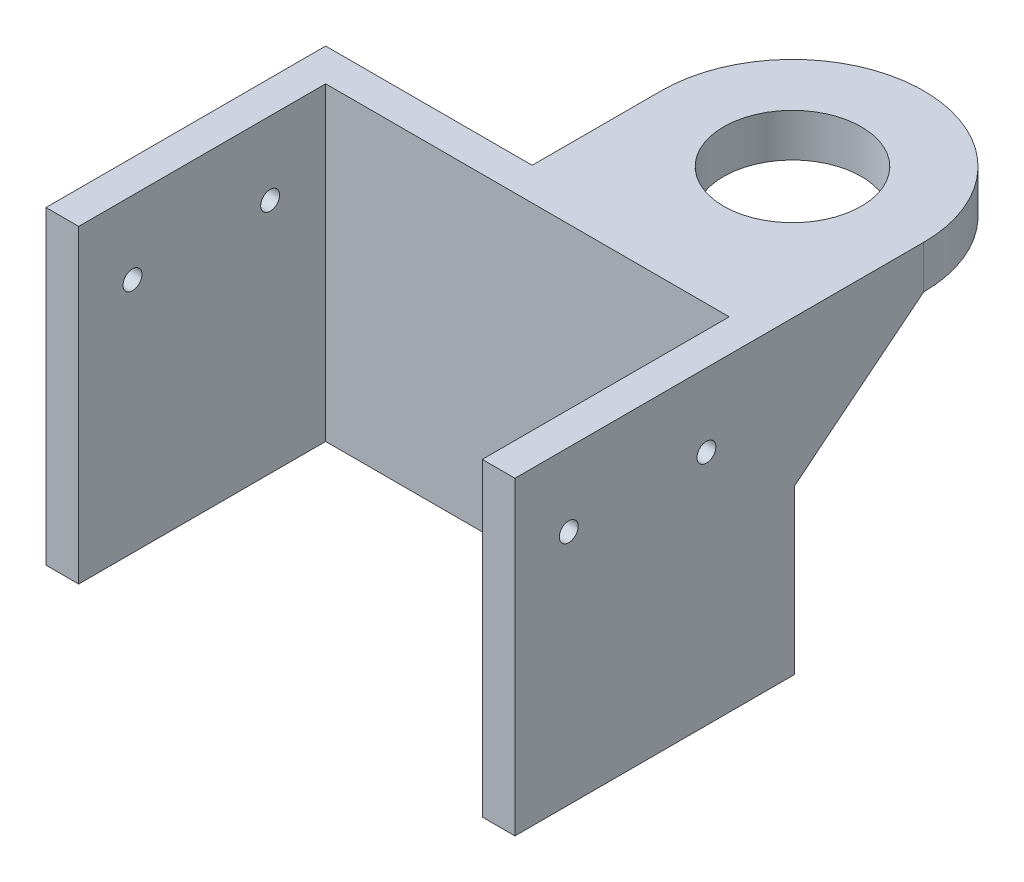
ISO-10303-21;
HEADER;
FILE_DESCRIPTION(('STEP AP214'),'2;1');
FILE_NAME('part.step','',(''),(''),'','','');
FILE_SCHEMA(('AUTOMOTIVE_DESIGN { 1 0 10303 214 1 1 1 1 }'));
ENDSEC;
DATA;
#1=APPLICATION_CONTEXT('core data for automotive mechanical design processes');
#2=APPLICATION_PROTOCOL_DEFINITION('international standard','automotive_design',2000,#1);
#3=PRODUCT_CONTEXT('',#1,'mechanical');
#4=PRODUCT('Part','Part','',(#3));
#5=PRODUCT_RELATED_PRODUCT_CATEGORY('part','',(#4));
#6=PRODUCT_DEFINITION_FORMATION('','',#4);
#7=PRODUCT_DEFINITION_CONTEXT('part definition',#1,'design');
#8=PRODUCT_DEFINITION('design','',#6,#7);
#9=PRODUCT_DEFINITION_SHAPE('','',#8);
#10=(LENGTH_UNIT() NAMED_UNIT(*) SI_UNIT(.MILLI.,.METRE.));
#11=(NAMED_UNIT(*) PLANE_ANGLE_UNIT() SI_UNIT($,.RADIAN.));
#12=(NAMED_UNIT(*) SI_UNIT($,.STERADIAN.) SOLID_ANGLE_UNIT());
#13=UNCERTAINTY_MEASURE_WITH_UNIT(LENGTH_MEASURE(1.E-05),#10,'distance_accuracy_value','');
#14=(GEOMETRIC_REPRESENTATION_CONTEXT(3) GLOBAL_UNCERTAINTY_ASSIGNED_CONTEXT((#13)) GLOBAL_UNIT_ASSIGNED_CONTEXT((#10,
#11,#12)) REPRESENTATION_CONTEXT('',''));
#15=CARTESIAN_POINT('',(0.,0.,0.));
#16=DIRECTION('',(0.,0.,1.));
#17=DIRECTION('',(1.,0.,0.));
#18=AXIS2_PLACEMENT_3D('',#15,#16,#17);
#19=CARTESIAN_POINT('',(-22.7158154859967,34.,12.6149093904448));
#20=DIRECTION('',(0.,0.,-1.));
#21=DIRECTION('',(-1.,0.,0.));
#22=AXIS2_PLACEMENT_3D('',#19,#20,#21);
#23=PLANE('',#22);
#24=DIRECTION('',(0.,-1.,0.));
#25=VECTOR('',#24,1.);
#26=CARTESIAN_POINT('',(-22.7158154859967,34.,12.6149093904448));
#27=LINE('',#26,#25);
#28=CARTESIAN_POINT('',(-22.7158154859967,34.,12.6149093904448));
#29=VERTEX_POINT('',#28);
#30=CARTESIAN_POINT('',(-22.7158154859967,-2.,12.6149093904448));
#31=VERTEX_POINT('',#30);
#32=EDGE_CURVE('E11',#29,#31,#27,.T.);
#33=ORIENTED_EDGE('',*,*,#32,.T.);
#34=DIRECTION('',(1.,0.,0.));
#35=VECTOR('',#34,1.);
#36=CARTESIAN_POINT('',(-18.9158154859967,-2.,12.6149093904448));
#37=LINE('',#36,#35);
#38=CARTESIAN_POINT('',(-18.9158154859967,-2.,12.6149093904448));
#39=VERTEX_POINT('',#38);
#40=EDGE_CURVE('E158',#31,#39,#37,.T.);
#41=ORIENTED_EDGE('',*,*,#40,.T.);
#42=DIRECTION('',(0.,1.,0.));
#43=VECTOR('',#42,1.);
#44=CARTESIAN_POINT('',(-18.9158154859967,0.,12.6149093904448));
#45=LINE('',#44,#43);
#46=CARTESIAN_POINT('',(-18.9158154859967,34.,12.6149093904448));
#47=VERTEX_POINT('',#46);
#48=EDGE_CURVE('E141',#39,#47,#45,.T.);
#49=ORIENTED_EDGE('',*,*,#48,.T.);
#50=DIRECTION('',(1.,0.,0.));
#51=VECTOR('',#50,1.);
#52=CARTESIAN_POINT('',(-22.7158154859967,34.,12.6149093904448));
#53=LINE('',#52,#51);
#54=EDGE_CURVE('E268',#29,#47,#53,.T.);
#55=ORIENTED_EDGE('',*,*,#54,.F.);
#56=EDGE_LOOP('',(#33,#41,#49,#55));
#57=FACE_BOUND('',#56,.T.);
#58=ADVANCED_FACE('F37',(#57),#23,.F.);
#59=CARTESIAN_POINT('',(-22.7158154859967,34.,-19.8850906095552));
#60=DIRECTION('',(0.,0.,1.));
#61=DIRECTION('',(1.,0.,0.));
#62=AXIS2_PLACEMENT_3D('',#59,#60,#61);
#63=PLANE('',#62);
#64=DIRECTION('',(1.,0.,0.));
#65=VECTOR('',#64,1.);
#66=CARTESIAN_POINT('',(27.7841845140033,17.,-19.8850906095552));
#67=LINE('',#66,#65);
#68=CARTESIAN_POINT('',(27.7841845140033,17.,-19.8850906095552));
#69=VERTEX_POINT('',#68);
#70=CARTESIAN_POINT('',(31.7841845140033,17.,-19.8850906095552));
#71=VERTEX_POINT('',#70);
#72=EDGE_CURVE('E225',#69,#71,#67,.T.);
#73=ORIENTED_EDGE('',*,*,#72,.T.);
#74=DIRECTION('',(0.,-1.,0.));
#75=VECTOR('',#74,1.);
#76=CARTESIAN_POINT('',(31.7841845140033,34.,-19.8850906095552));
#77=LINE('',#76,#75);
#78=CARTESIAN_POINT('',(31.7841845140033,-2.,-19.8850906095552));
#79=VERTEX_POINT('',#78);
#80=EDGE_CURVE('E275',#71,#79,#77,.T.);
#81=ORIENTED_EDGE('',*,*,#80,.T.);
#82=DIRECTION('',(-1.,0.,0.));
#83=VECTOR('',#82,1.);
#84=CARTESIAN_POINT('',(-22.7158154859967,-2.,-19.8850906095552));
#85=LINE('',#84,#83);
#86=CARTESIAN_POINT('',(-22.7158154859967,-2.,-19.8850906095552));
#87=VERTEX_POINT('',#86);
#88=EDGE_CURVE('E182',#79,#87,#85,.T.);
#89=ORIENTED_EDGE('',*,*,#88,.T.);
#90=DIRECTION('',(0.,-1.,0.));
#91=VECTOR('',#90,1.);
#92=CARTESIAN_POINT('',(-22.7158154859967,34.,-19.8850906095552));
#93=LINE('',#92,#91);
#94=CARTESIAN_POINT('',(-22.7158154859967,34.,-19.8850906095552));
#95=VERTEX_POINT('',#94);
#96=EDGE_CURVE('E273',#95,#87,#93,.T.);
#97=ORIENTED_EDGE('',*,*,#96,.F.);
#98=DIRECTION('',(-1.,0.,0.));
#99=VECTOR('',#98,1.);
#100=CARTESIAN_POINT('',(-22.7158154859967,34.,-19.8850906095552));
#101=LINE('',#100,#99);
#102=CARTESIAN_POINT('',(1.28418451400331,34.,-19.8850906095552));
#103=VERTEX_POINT('',#102);
#104=EDGE_CURVE('E54',#103,#95,#101,.T.);
#105=ORIENTED_EDGE('',*,*,#104,.F.);
#106=DIRECTION('',(0.,1.,0.));
#107=VECTOR('',#106,1.);
#108=CARTESIAN_POINT('',(1.28418451400331,29.,-19.8850906095552));
#109=LINE('',#108,#107);
#110=CARTESIAN_POINT('',(1.28418451400331,17.,-19.8850906095552));
#111=VERTEX_POINT('',#110);
#112=EDGE_CURVE('E264',#111,#103,#109,.T.);
#113=ORIENTED_EDGE('',*,*,#112,.F.);
#114=DIRECTION('',(-1.,0.,0.));
#115=VECTOR('',#114,1.);
#116=CARTESIAN_POINT('',(5.28418451400331,17.,-19.8850906095552));
#117=LINE('',#116,#115);
#118=CARTESIAN_POINT('',(5.28418451400331,17.,-19.8850906095552));
#119=VERTEX_POINT('',#118);
#120=EDGE_CURVE('E243',#119,#111,#117,.T.);
#121=ORIENTED_EDGE('',*,*,#120,.F.);
#122=DIRECTION('',(0.,1.,0.));
#123=VECTOR('',#122,1.);
#124=CARTESIAN_POINT('',(5.28418451400331,17.,-19.8850906095552));
#125=LINE('',#124,#123);
#126=CARTESIAN_POINT('',(5.28418451400331,29.,-19.8850906095552));
#127=VERTEX_POINT('',#126);
#128=EDGE_CURVE('E237',#119,#127,#125,.T.);
#129=ORIENTED_EDGE('',*,*,#128,.T.);
#130=DIRECTION('',(1.,0.,0.));
#131=VECTOR('',#130,1.);
#132=CARTESIAN_POINT('',(1.28418451400331,29.,-19.8850906095552));
#133=LINE('',#132,#131);
#134=CARTESIAN_POINT('',(27.7841845140033,29.,-19.8850906095552));
#135=VERTEX_POINT('',#134);
#136=EDGE_CURVE('E252',#127,#135,#133,.T.);
#137=ORIENTED_EDGE('',*,*,#136,.T.);
#138=DIRECTION('',(0.,1.,0.));
#139=VECTOR('',#138,1.);
#140=CARTESIAN_POINT('',(27.7841845140033,17.,-19.8850906095552));
#141=LINE('',#140,#139);
#142=EDGE_CURVE('E221',#69,#135,#141,.T.);
#143=ORIENTED_EDGE('',*,*,#142,.F.);
#144=EDGE_LOOP('',(#73,#81,#89,#97,#105,#113,#121,#129,#137,#143));
#145=FACE_BOUND('',#144,.T.);
#146=ADVANCED_FACE('F304',(#145),#63,.F.);
#147=CARTESIAN_POINT('',(16.5341845140033,29.,-34.8850906095552));
#148=DIRECTION('',(0.,1.,0.));
#149=DIRECTION('',(0.,0.,1.));
#150=AXIS2_PLACEMENT_3D('',#147,#148,#149);
#151=PLANE('',#150);
#152=CARTESIAN_POINT('',(16.5341845140033,29.,-34.8850906095552));
#153=DIRECTION('',(0.,1.,0.));
#154=DIRECTION('',(0.,0.,1.));
#155=AXIS2_PLACEMENT_3D('',#152,#153,#154);
#156=CIRCLE('',#155,8.);
#157=CARTESIAN_POINT('',(16.5341845140033,29.,-26.8850906095552));
#158=VERTEX_POINT('',#157);
#159=EDGE_CURVE('E165',#158,#158,#156,.T.);
#160=ORIENTED_EDGE('',*,*,#159,.T.);
#161=EDGE_LOOP('',(#160));
#162=FACE_BOUND('',#161,.T.);
#163=DIRECTION('',(1.,0.,0.));
#164=VECTOR('',#163,1.);
#165=CARTESIAN_POINT('',(27.7841845140033,29.,-34.8850906095552));
#166=LINE('',#165,#164);
#167=CARTESIAN_POINT('',(27.7841845140033,29.,-34.8850906095552));
#168=VERTEX_POINT('',#167);
#169=CARTESIAN_POINT('',(31.7841845140033,29.,-34.8850906095552));
#170=VERTEX_POINT('',#169);
#171=EDGE_CURVE('E227',#168,#170,#166,.T.);
#172=ORIENTED_EDGE('',*,*,#171,.F.);
#173=DIRECTION('',(0.,0.,-1.));
#174=VECTOR('',#173,1.);
#175=CARTESIAN_POINT('',(27.7841845140033,29.,-19.8850906095552));
#176=LINE('',#175,#174);
#177=EDGE_CURVE('E218',#135,#168,#176,.T.);
#178=ORIENTED_EDGE('',*,*,#177,.F.);
#179=ORIENTED_EDGE('',*,*,#136,.F.);
#180=DIRECTION('',(0.,0.,-1.));
#181=VECTOR('',#180,1.);
#182=CARTESIAN_POINT('',(5.28418451400331,29.,-19.8850906095552));
#183=LINE('',#182,#181);
#184=CARTESIAN_POINT('',(5.2841845140033,29.,-34.8850906095552));
#185=VERTEX_POINT('',#184);
#186=EDGE_CURVE('E232',#127,#185,#183,.T.);
#187=ORIENTED_EDGE('',*,*,#186,.T.);
#188=DIRECTION('',(-1.,0.,0.));
#189=VECTOR('',#188,1.);
#190=CARTESIAN_POINT('',(5.2841845140033,29.,-34.8850906095552));
#191=LINE('',#190,#189);
#192=CARTESIAN_POINT('',(1.2841845140033,29.,-34.8850906095552));
#193=VERTEX_POINT('',#192);
#194=EDGE_CURVE('E240',#185,#193,#191,.T.);
#195=ORIENTED_EDGE('',*,*,#194,.T.);
#196=CARTESIAN_POINT('',(16.5341845140033,29.,-34.8850906095552));
#197=DIRECTION('',(0.,1.,0.));
#198=DIRECTION('',(0.,0.,1.));
#199=AXIS2_PLACEMENT_3D('',#196,#197,#198);
#200=CIRCLE('',#199,15.25);
#201=EDGE_CURVE('E249',#170,#193,#200,.T.);
#202=ORIENTED_EDGE('',*,*,#201,.F.);
#203=EDGE_LOOP('',(#172,#178,#179,#187,#195,#202));
#204=FACE_BOUND('',#203,.T.);
#205=ADVANCED_FACE('F325',(#162,#204),#151,.F.);
#206=CARTESIAN_POINT('',(-22.7158154859967,34.,-19.8850906095552));
#207=DIRECTION('',(1.,0.,0.));
#208=DIRECTION('',(0.,0.,-1.));
#209=AXIS2_PLACEMENT_3D('',#206,#207,#208);
#210=PLANE('',#209);
#211=CARTESIAN_POINT('',(-22.7158154859967,25.5,6.36490939044482));
#212=DIRECTION('',(1.,0.,0.));
#213=DIRECTION('',(0.,0.,-1.));
#214=AXIS2_PLACEMENT_3D('',#211,#212,#213);
#215=CIRCLE('',#214,1.1);
#216=CARTESIAN_POINT('',(-22.7158154859967,25.5,5.26490939044482));
#217=VERTEX_POINT('',#216);
#218=EDGE_CURVE('E203',#217,#217,#215,.T.);
#219=ORIENTED_EDGE('',*,*,#218,.T.);
#220=EDGE_LOOP('',(#219));
#221=FACE_BOUND('',#220,.T.);
#222=CARTESIAN_POINT('',(-22.7158154859967,25.5,-9.63509060955518));
#223=DIRECTION('',(1.,0.,0.));
#224=DIRECTION('',(0.,0.,-1.));
#225=AXIS2_PLACEMENT_3D('',#222,#223,#224);
#226=CIRCLE('',#225,1.1);
#227=CARTESIAN_POINT('',(-22.7158154859967,25.5,-10.7350906095552));
#228=VERTEX_POINT('',#227);
#229=EDGE_CURVE('E194',#228,#228,#226,.T.);
#230=ORIENTED_EDGE('',*,*,#229,.T.);
#231=EDGE_LOOP('',(#230));
#232=FACE_BOUND('',#231,.T.);
#233=ORIENTED_EDGE('',*,*,#96,.T.);
#234=DIRECTION('',(0.,0.,1.));
#235=VECTOR('',#234,1.);
#236=CARTESIAN_POINT('',(-22.7158154859967,-2.,12.6149093904448));
#237=LINE('',#236,#235);
#238=EDGE_CURVE('E185',#87,#31,#237,.T.);
#239=ORIENTED_EDGE('',*,*,#238,.T.);
#240=ORIENTED_EDGE('',*,*,#32,.F.);
#241=DIRECTION('',(0.,0.,1.));
#242=VECTOR('',#241,1.);
#243=CARTESIAN_POINT('',(-22.7158154859967,34.,-19.8850906095552));
#244=LINE('',#243,#242);
#245=EDGE_CURVE('E263',#95,#29,#244,.T.);
#246=ORIENTED_EDGE('',*,*,#245,.F.);
#247=EDGE_LOOP('',(#233,#239,#240,#246));
#248=FACE_BOUND('',#247,.T.);
#249=ADVANCED_FACE('F39',(#221,#232,#248),#210,.F.);
#250=CARTESIAN_POINT('',(27.9841845140033,34.,12.6149093904448));
#251=VERTEX_POINT('',#250);
#252=CARTESIAN_POINT('',(31.7841845140033,34.,12.6149093904448));
#253=VERTEX_POINT('',#252);
#254=EDGE_CURVE('E61',#251,#253,#53,.T.);
#255=ORIENTED_EDGE('',*,*,#254,.F.);
#256=DIRECTION('',(0.,1.,0.));
#257=VECTOR('',#256,1.);
#258=CARTESIAN_POINT('',(27.9841845140033,0.,12.6149093904448));
#259=LINE('',#258,#257);
#260=CARTESIAN_POINT('',(27.9841845140033,-2.,12.6149093904448));
#261=VERTEX_POINT('',#260);
#262=EDGE_CURVE('E150',#261,#251,#259,.T.);
#263=ORIENTED_EDGE('',*,*,#262,.F.);
#264=DIRECTION('',(1.,0.,0.));
#265=VECTOR('',#264,1.);
#266=CARTESIAN_POINT('',(31.7841845140033,-2.,12.6149093904448));
#267=LINE('',#266,#265);
#268=CARTESIAN_POINT('',(31.7841845140033,-2.,12.6149093904448));
#269=VERTEX_POINT('',#268);
#270=EDGE_CURVE('E176',#261,#269,#267,.T.);
#271=ORIENTED_EDGE('',*,*,#270,.T.);
#272=DIRECTION('',(0.,-1.,0.));
#273=VECTOR('',#272,1.);
#274=CARTESIAN_POINT('',(31.7841845140033,34.,12.6149093904448));
#275=LINE('',#274,#273);
#276=EDGE_CURVE('E46',#253,#269,#275,.T.);
#277=ORIENTED_EDGE('',*,*,#276,.F.);
#278=EDGE_LOOP('',(#255,#263,#271,#277));
#279=FACE_BOUND('',#278,.T.);
#280=ADVANCED_FACE('F295',(#279),#23,.F.);
#281=CARTESIAN_POINT('',(31.7841845140033,34.,-19.8850906095552));
#282=DIRECTION('',(-1.,0.,0.));
#283=DIRECTION('',(0.,0.,1.));
#284=AXIS2_PLACEMENT_3D('',#281,#282,#283);
#285=PLANE('',#284);
#286=CARTESIAN_POINT('',(31.7841845140033,25.5,6.3649093904448));
#287=DIRECTION('',(-1.,0.,0.));
#288=DIRECTION('',(0.,0.,1.));
#289=AXIS2_PLACEMENT_3D('',#286,#287,#288);
#290=CIRCLE('',#289,1.1);
#291=CARTESIAN_POINT('',(31.7841845140033,25.5,7.4649093904448));
#292=VERTEX_POINT('',#291);
#293=EDGE_CURVE('E200',#292,#292,#290,.T.);
#294=ORIENTED_EDGE('',*,*,#293,.T.);
#295=EDGE_LOOP('',(#294));
#296=FACE_BOUND('',#295,.T.);
#297=CARTESIAN_POINT('',(31.7841845140033,25.5,-9.6350906095552));
#298=DIRECTION('',(-1.,0.,0.));
#299=DIRECTION('',(0.,0.,1.));
#300=AXIS2_PLACEMENT_3D('',#297,#298,#299);
#301=CIRCLE('',#300,1.1);
#302=CARTESIAN_POINT('',(31.7841845140033,25.5,-8.5350906095552));
#303=VERTEX_POINT('',#302);
#304=EDGE_CURVE('E191',#303,#303,#301,.T.);
#305=ORIENTED_EDGE('',*,*,#304,.T.);
#306=EDGE_LOOP('',(#305));
#307=FACE_BOUND('',#306,.T.);
#308=ORIENTED_EDGE('',*,*,#80,.F.);
#309=DIRECTION('',(0.,-0.624695047554425,0.78086880944303));
#310=VECTOR('',#309,1.);
#311=CARTESIAN_POINT('',(31.7841845140033,29.,-34.8850906095552));
#312=LINE('',#311,#310);
#313=EDGE_CURVE('E214',#170,#71,#312,.T.);
#314=ORIENTED_EDGE('',*,*,#313,.F.);
#315=DIRECTION('',(0.,1.,0.));
#316=VECTOR('',#315,1.);
#317=CARTESIAN_POINT('',(31.7841845140033,29.,-34.8850906095552));
#318=LINE('',#317,#316);
#319=CARTESIAN_POINT('',(31.7841845140033,34.,-34.8850906095552));
#320=VERTEX_POINT('',#319);
#321=EDGE_CURVE('E260',#170,#320,#318,.T.);
#322=ORIENTED_EDGE('',*,*,#321,.T.);
#323=DIRECTION('',(0.,0.,-1.));
#324=VECTOR('',#323,1.);
#325=CARTESIAN_POINT('',(31.7841845140033,34.,-19.8850906095552));
#326=LINE('',#325,#324);
#327=EDGE_CURVE('E270',#253,#320,#326,.T.);
#328=ORIENTED_EDGE('',*,*,#327,.F.);
#329=ORIENTED_EDGE('',*,*,#276,.T.);
#330=DIRECTION('',(0.,0.,-1.));
#331=VECTOR('',#330,1.);
#332=CARTESIAN_POINT('',(31.7841845140033,-2.,-19.8850906095552));
#333=LINE('',#332,#331);
#334=EDGE_CURVE('E179',#269,#79,#333,.T.);
#335=ORIENTED_EDGE('',*,*,#334,.T.);
#336=EDGE_LOOP('',(#308,#314,#322,#328,#329,#335));
#337=FACE_BOUND('',#336,.T.);
#338=ADVANCED_FACE('F291',(#296,#307,#337),#285,.F.);
#339=CARTESIAN_POINT('',(0.,34.,0.));
#340=DIRECTION('',(0.,1.,0.));
#341=DIRECTION('',(0.,0.,1.));
#342=AXIS2_PLACEMENT_3D('',#339,#340,#341);
#343=PLANE('',#342);
#344=CARTESIAN_POINT('',(16.5341845140033,34.,-34.8850906095552));
#345=DIRECTION('',(0.,1.,0.));
#346=DIRECTION('',(0.,0.,1.));
#347=AXIS2_PLACEMENT_3D('',#344,#345,#346);
#348=CIRCLE('',#347,8.);
#349=CARTESIAN_POINT('',(16.5341845140033,34.,-26.8850906095552));
#350=VERTEX_POINT('',#349);
#351=EDGE_CURVE('E168',#350,#350,#348,.T.);
#352=ORIENTED_EDGE('',*,*,#351,.F.);
#353=EDGE_LOOP('',(#352));
#354=FACE_BOUND('',#353,.T.);
#355=DIRECTION('',(0.,0.,1.));
#356=VECTOR('',#355,1.);
#357=CARTESIAN_POINT('',(-18.9158154859967,34.,12.6149093904448));
#358=LINE('',#357,#356);
#359=CARTESIAN_POINT('',(-18.9158154859967,34.,-16.0850906095552));
#360=VERTEX_POINT('',#359);
#361=EDGE_CURVE('E146',#360,#47,#358,.T.);
#362=ORIENTED_EDGE('',*,*,#361,.F.);
#363=DIRECTION('',(-1.,0.,0.));
#364=VECTOR('',#363,1.);
#365=CARTESIAN_POINT('',(-18.9158154859967,34.,-16.0850906095552));
#366=LINE('',#365,#364);
#367=CARTESIAN_POINT('',(27.9841845140033,34.,-16.0850906095552));
#368=VERTEX_POINT('',#367);
#369=EDGE_CURVE('E151',#368,#360,#366,.T.);
#370=ORIENTED_EDGE('',*,*,#369,.F.);
#371=DIRECTION('',(0.,0.,-1.));
#372=VECTOR('',#371,1.);
#373=CARTESIAN_POINT('',(27.9841845140033,34.,12.6149093904448));
#374=LINE('',#373,#372);
#375=EDGE_CURVE('E207',#251,#368,#374,.T.);
#376=ORIENTED_EDGE('',*,*,#375,.F.);
#377=ORIENTED_EDGE('',*,*,#254,.T.);
#378=ORIENTED_EDGE('',*,*,#327,.T.);
#379=CARTESIAN_POINT('',(16.5341845140033,34.,-34.8850906095552));
#380=DIRECTION('',(0.,1.,0.));
#381=DIRECTION('',(0.,0.,1.));
#382=AXIS2_PLACEMENT_3D('',#379,#380,#381);
#383=CIRCLE('',#382,15.25);
#384=CARTESIAN_POINT('',(1.2841845140033,34.,-34.8850906095552));
#385=VERTEX_POINT('',#384);
#386=EDGE_CURVE('E246',#320,#385,#383,.T.);
#387=ORIENTED_EDGE('',*,*,#386,.T.);
#388=DIRECTION('',(0.,0.,1.));
#389=VECTOR('',#388,1.);
#390=CARTESIAN_POINT('',(1.2841845140033,34.,-34.8850906095552));
#391=LINE('',#390,#389);
#392=EDGE_CURVE('E253',#385,#103,#391,.T.);
#393=ORIENTED_EDGE('',*,*,#392,.T.);
#394=ORIENTED_EDGE('',*,*,#104,.T.);
#395=ORIENTED_EDGE('',*,*,#245,.T.);
#396=ORIENTED_EDGE('',*,*,#54,.T.);
#397=EDGE_LOOP('',(#362,#370,#376,#377,#378,#387,#393,#394,#395,#396));
#398=FACE_BOUND('',#397,.T.);
#399=ADVANCED_FACE('F294',(#354,#398),#343,.T.);
#400=CARTESIAN_POINT('',(16.5341845140033,29.,-34.8850906095552));
#401=DIRECTION('',(0.,1.,0.));
#402=DIRECTION('',(0.,0.,1.));
#403=AXIS2_PLACEMENT_3D('',#400,#401,#402);
#404=CYLINDRICAL_SURFACE('',#403,15.25);
#405=ORIENTED_EDGE('',*,*,#386,.F.);
#406=ORIENTED_EDGE('',*,*,#321,.F.);
#407=ORIENTED_EDGE('',*,*,#201,.T.);
#408=DIRECTION('',(0.,1.,0.));
#409=VECTOR('',#408,1.);
#410=CARTESIAN_POINT('',(1.2841845140033,29.,-34.8850906095552));
#411=LINE('',#410,#409);
#412=EDGE_CURVE('E256',#193,#385,#411,.T.);
#413=ORIENTED_EDGE('',*,*,#412,.T.);
#414=EDGE_LOOP('',(#405,#406,#407,#413));
#415=FACE_BOUND('',#414,.T.);
#416=ADVANCED_FACE('F322',(#415),#404,.T.);
#417=CARTESIAN_POINT('',(1.2841845140033,29.,-34.8850906095552));
#418=DIRECTION('',(-1.,0.,0.));
#419=DIRECTION('',(0.,0.,1.));
#420=AXIS2_PLACEMENT_3D('',#417,#418,#419);
#421=PLANE('',#420);
#422=ORIENTED_EDGE('',*,*,#412,.F.);
#423=DIRECTION('',(0.,-0.624695047554425,0.78086880944303));
#424=VECTOR('',#423,1.);
#425=CARTESIAN_POINT('',(1.2841845140033,29.,-34.8850906095552));
#426=LINE('',#425,#424);
#427=EDGE_CURVE('E229',#193,#111,#426,.T.);
#428=ORIENTED_EDGE('',*,*,#427,.T.);
#429=ORIENTED_EDGE('',*,*,#112,.T.);
#430=ORIENTED_EDGE('',*,*,#392,.F.);
#431=EDGE_LOOP('',(#422,#428,#429,#430));
#432=FACE_BOUND('',#431,.T.);
#433=ADVANCED_FACE('F318',(#432),#421,.T.);
#434=CARTESIAN_POINT('',(5.2841845140033,29.,-34.8850906095552));
#435=DIRECTION('',(0.,-0.78086880944303,-0.624695047554425));
#436=DIRECTION('',(0.,0.624695047554425,-0.78086880944303));
#437=AXIS2_PLACEMENT_3D('',#434,#435,#436);
#438=PLANE('',#437);
#439=ORIENTED_EDGE('',*,*,#427,.F.);
#440=ORIENTED_EDGE('',*,*,#194,.F.);
#441=DIRECTION('',(0.,-0.624695047554425,0.78086880944303));
#442=VECTOR('',#441,1.);
#443=CARTESIAN_POINT('',(5.2841845140033,29.,-34.8850906095552));
#444=LINE('',#443,#442);
#445=EDGE_CURVE('E235',#185,#119,#444,.T.);
#446=ORIENTED_EDGE('',*,*,#445,.T.);
#447=ORIENTED_EDGE('',*,*,#120,.T.);
#448=EDGE_LOOP('',(#439,#440,#446,#447));
#449=FACE_BOUND('',#448,.T.);
#450=ADVANCED_FACE('F314',(#449),#438,.T.);
#451=CARTESIAN_POINT('',(5.28418451400331,0.,0.));
#452=DIRECTION('',(1.,0.,0.));
#453=DIRECTION('',(0.,0.,-1.));
#454=AXIS2_PLACEMENT_3D('',#451,#452,#453);
#455=PLANE('',#454);
#456=ORIENTED_EDGE('',*,*,#186,.F.);
#457=ORIENTED_EDGE('',*,*,#128,.F.);
#458=ORIENTED_EDGE('',*,*,#445,.F.);
#459=EDGE_LOOP('',(#456,#457,#458));
#460=FACE_BOUND('',#459,.T.);
#461=ADVANCED_FACE('F329',(#460),#455,.T.);
#462=CARTESIAN_POINT('',(27.7841845140033,29.,-34.8850906095552));
#463=DIRECTION('',(0.,0.78086880944303,0.624695047554425));
#464=DIRECTION('',(0.,-0.624695047554425,0.78086880944303));
#465=AXIS2_PLACEMENT_3D('',#462,#463,#464);
#466=PLANE('',#465);
#467=ORIENTED_EDGE('',*,*,#313,.T.);
#468=ORIENTED_EDGE('',*,*,#72,.F.);
#469=DIRECTION('',(0.,-0.624695047554425,0.78086880944303));
#470=VECTOR('',#469,1.);
#471=CARTESIAN_POINT('',(27.7841845140033,29.,-34.8850906095552));
#472=LINE('',#471,#470);
#473=EDGE_CURVE('E223',#168,#69,#472,.T.);
#474=ORIENTED_EDGE('',*,*,#473,.F.);
#475=ORIENTED_EDGE('',*,*,#171,.T.);
#476=EDGE_LOOP('',(#467,#468,#474,#475));
#477=FACE_BOUND('',#476,.T.);
#478=ADVANCED_FACE('F333',(#477),#466,.F.);
#479=CARTESIAN_POINT('',(27.7841845140033,0.,0.));
#480=DIRECTION('',(-1.,0.,0.));
#481=DIRECTION('',(0.,0.,-1.));
#482=AXIS2_PLACEMENT_3D('',#479,#480,#481);
#483=PLANE('',#482);
#484=ORIENTED_EDGE('',*,*,#177,.T.);
#485=ORIENTED_EDGE('',*,*,#473,.T.);
#486=ORIENTED_EDGE('',*,*,#142,.T.);
#487=EDGE_LOOP('',(#484,#485,#486));
#488=FACE_BOUND('',#487,.T.);
#489=ADVANCED_FACE('F331',(#488),#483,.T.);
#490=CARTESIAN_POINT('',(-18.9158154859967,0.,12.6149093904448));
#491=DIRECTION('',(-1.,0.,0.));
#492=DIRECTION('',(0.,0.,1.));
#493=AXIS2_PLACEMENT_3D('',#490,#491,#492);
#494=PLANE('',#493);
#495=CARTESIAN_POINT('',(-18.9158154859967,25.5,6.36490939044482));
#496=DIRECTION('',(-1.,0.,0.));
#497=DIRECTION('',(0.,0.,1.));
#498=AXIS2_PLACEMENT_3D('',#495,#496,#497);
#499=CIRCLE('',#498,1.1);
#500=CARTESIAN_POINT('',(-18.9158154859967,25.5,7.46490939044482));
#501=VERTEX_POINT('',#500);
#502=EDGE_CURVE('E197',#501,#501,#499,.T.);
#503=ORIENTED_EDGE('',*,*,#502,.T.);
#504=EDGE_LOOP('',(#503));
#505=FACE_BOUND('',#504,.T.);
#506=CARTESIAN_POINT('',(-18.9158154859967,25.5,-9.63509060955519));
#507=DIRECTION('',(-1.,0.,0.));
#508=DIRECTION('',(0.,0.,1.));
#509=AXIS2_PLACEMENT_3D('',#506,#507,#508);
#510=CIRCLE('',#509,1.1);
#511=CARTESIAN_POINT('',(-18.9158154859967,25.5,-8.53509060955519));
#512=VERTEX_POINT('',#511);
#513=EDGE_CURVE('E188',#512,#512,#510,.T.);
#514=ORIENTED_EDGE('',*,*,#513,.T.);
#515=EDGE_LOOP('',(#514));
#516=FACE_BOUND('',#515,.T.);
#517=ORIENTED_EDGE('',*,*,#361,.T.);
#518=ORIENTED_EDGE('',*,*,#48,.F.);
#519=DIRECTION('',(0.,0.,-1.));
#520=VECTOR('',#519,1.);
#521=CARTESIAN_POINT('',(-18.9158154859967,-2.,-16.0850906095552));
#522=LINE('',#521,#520);
#523=CARTESIAN_POINT('',(-18.9158154859967,-2.,-16.0850906095552));
#524=VERTEX_POINT('',#523);
#525=EDGE_CURVE('E144',#39,#524,#522,.T.);
#526=ORIENTED_EDGE('',*,*,#525,.T.);
#527=DIRECTION('',(0.,1.,0.));
#528=VECTOR('',#527,1.);
#529=CARTESIAN_POINT('',(-18.9158154859967,0.,-16.0850906095552));
#530=LINE('',#529,#528);
#531=EDGE_CURVE('E212',#524,#360,#530,.T.);
#532=ORIENTED_EDGE('',*,*,#531,.T.);
#533=EDGE_LOOP('',(#517,#518,#526,#532));
#534=FACE_BOUND('',#533,.T.);
#535=ADVANCED_FACE('F143',(#505,#516,#534),#494,.F.);
#536=CARTESIAN_POINT('',(-18.9158154859967,0.,-16.0850906095552));
#537=DIRECTION('',(0.,0.,-1.));
#538=DIRECTION('',(-1.,0.,0.));
#539=AXIS2_PLACEMENT_3D('',#536,#537,#538);
#540=PLANE('',#539);
#541=ORIENTED_EDGE('',*,*,#369,.T.);
#542=ORIENTED_EDGE('',*,*,#531,.F.);
#543=DIRECTION('',(1.,0.,0.));
#544=VECTOR('',#543,1.);
#545=CARTESIAN_POINT('',(27.9841845140033,-2.,-16.0850906095552));
#546=LINE('',#545,#544);
#547=CARTESIAN_POINT('',(27.9841845140033,-2.,-16.0850906095552));
#548=VERTEX_POINT('',#547);
#549=EDGE_CURVE('E162',#524,#548,#546,.T.);
#550=ORIENTED_EDGE('',*,*,#549,.T.);
#551=DIRECTION('',(0.,1.,0.));
#552=VECTOR('',#551,1.);
#553=CARTESIAN_POINT('',(27.9841845140033,0.,-16.0850906095552));
#554=LINE('',#553,#552);
#555=EDGE_CURVE('E215',#548,#368,#554,.T.);
#556=ORIENTED_EDGE('',*,*,#555,.T.);
#557=EDGE_LOOP('',(#541,#542,#550,#556));
#558=FACE_BOUND('',#557,.T.);
#559=ADVANCED_FACE('F476',(#558),#540,.F.);
#560=CARTESIAN_POINT('',(27.9841845140033,0.,12.6149093904448));
#561=DIRECTION('',(1.,0.,0.));
#562=DIRECTION('',(0.,0.,-1.));
#563=AXIS2_PLACEMENT_3D('',#560,#561,#562);
#564=PLANE('',#563);
#565=CARTESIAN_POINT('',(27.9841845140033,25.5,6.3649093904448));
#566=DIRECTION('',(1.,0.,0.));
#567=DIRECTION('',(0.,0.,-1.));
#568=AXIS2_PLACEMENT_3D('',#565,#566,#567);
#569=CIRCLE('',#568,1.1);
#570=CARTESIAN_POINT('',(27.9841845140033,25.5,5.2649093904448));
#571=VERTEX_POINT('',#570);
#572=EDGE_CURVE('E41',#571,#571,#569,.T.);
#573=ORIENTED_EDGE('',*,*,#572,.T.);
#574=EDGE_LOOP('',(#573));
#575=FACE_BOUND('',#574,.T.);
#576=CARTESIAN_POINT('',(27.9841845140033,25.5,-9.6350906095552));
#577=DIRECTION('',(1.,0.,0.));
#578=DIRECTION('',(0.,0.,-1.));
#579=AXIS2_PLACEMENT_3D('',#576,#577,#578);
#580=CIRCLE('',#579,1.1);
#581=CARTESIAN_POINT('',(27.9841845140033,25.5,-10.7350906095552));
#582=VERTEX_POINT('',#581);
#583=EDGE_CURVE('E187',#582,#582,#580,.T.);
#584=ORIENTED_EDGE('',*,*,#583,.T.);
#585=EDGE_LOOP('',(#584));
#586=FACE_BOUND('',#585,.T.);
#587=ORIENTED_EDGE('',*,*,#375,.T.);
#588=ORIENTED_EDGE('',*,*,#555,.F.);
#589=DIRECTION('',(0.,0.,1.));
#590=VECTOR('',#589,1.);
#591=CARTESIAN_POINT('',(27.9841845140033,-2.,12.6149093904448));
#592=LINE('',#591,#590);
#593=EDGE_CURVE('E173',#548,#261,#592,.T.);
#594=ORIENTED_EDGE('',*,*,#593,.T.);
#595=ORIENTED_EDGE('',*,*,#262,.T.);
#596=EDGE_LOOP('',(#587,#588,#594,#595));
#597=FACE_BOUND('',#596,.T.);
#598=ADVANCED_FACE('F280',(#575,#586,#597),#564,.F.);
#599=CARTESIAN_POINT('',(63.5341845140033,25.5,-9.63509060955521));
#600=DIRECTION('',(-1.,0.,0.));
#601=DIRECTION('',(0.,0.,1.));
#602=AXIS2_PLACEMENT_3D('',#599,#600,#601);
#603=CYLINDRICAL_SURFACE('',#602,1.1);
#604=ORIENTED_EDGE('',*,*,#583,.F.);
#605=EDGE_LOOP('',(#604));
#606=FACE_BOUND('',#605,.T.);
#607=ORIENTED_EDGE('',*,*,#304,.F.);
#608=EDGE_LOOP('',(#607));
#609=FACE_BOUND('',#608,.T.);
#610=ADVANCED_FACE('F283',(#606,#609),#603,.F.);
#611=CARTESIAN_POINT('',(63.5341845140033,25.5,6.3649093904448));
#612=DIRECTION('',(-1.,0.,0.));
#613=DIRECTION('',(0.,0.,1.));
#614=AXIS2_PLACEMENT_3D('',#611,#612,#613);
#615=CYLINDRICAL_SURFACE('',#614,1.1);
#616=ORIENTED_EDGE('',*,*,#572,.F.);
#617=EDGE_LOOP('',(#616));
#618=FACE_BOUND('',#617,.T.);
#619=ORIENTED_EDGE('',*,*,#293,.F.);
#620=EDGE_LOOP('',(#619));
#621=FACE_BOUND('',#620,.T.);
#622=ADVANCED_FACE('F286',(#618,#621),#615,.F.);
#623=ORIENTED_EDGE('',*,*,#513,.F.);
#624=EDGE_LOOP('',(#623));
#625=FACE_BOUND('',#624,.T.);
#626=ORIENTED_EDGE('',*,*,#229,.F.);
#627=EDGE_LOOP('',(#626));
#628=FACE_BOUND('',#627,.T.);
#629=ADVANCED_FACE('F288',(#625,#628),#603,.F.);
#630=ORIENTED_EDGE('',*,*,#502,.F.);
#631=EDGE_LOOP('',(#630));
#632=FACE_BOUND('',#631,.T.);
#633=ORIENTED_EDGE('',*,*,#218,.F.);
#634=EDGE_LOOP('',(#633));
#635=FACE_BOUND('',#634,.T.);
#636=ADVANCED_FACE('F423',(#632,#635),#615,.F.);
#637=CARTESIAN_POINT('',(0.,-2.,0.));
#638=DIRECTION('',(0.,-1.,0.));
#639=DIRECTION('',(0.,0.,-1.));
#640=AXIS2_PLACEMENT_3D('',#637,#638,#639);
#641=PLANE('',#640);
#642=CARTESIAN_POINT('',(29.7841845140033,-2.,-17.8850906095552));
#643=DIRECTION('',(0.,-1.,0.));
#644=DIRECTION('',(0.,0.,-1.));
#645=AXIS2_PLACEMENT_3D('',#642,#643,#644);
#646=CIRCLE('',#645,1.);
#647=CARTESIAN_POINT('',(29.7841845140033,-2.,-18.8850906095552));
#648=VERTEX_POINT('',#647);
#649=EDGE_CURVE('E571',#648,#648,#646,.T.);
#650=ORIENTED_EDGE('',*,*,#649,.F.);
#651=EDGE_LOOP('',(#650));
#652=FACE_BOUND('',#651,.T.);
#653=CARTESIAN_POINT('',(-20.7158154859967,-2.,-17.8850906095552));
#654=DIRECTION('',(0.,-1.,0.));
#655=DIRECTION('',(0.,0.,-1.));
#656=AXIS2_PLACEMENT_3D('',#653,#654,#655);
#657=CIRCLE('',#656,1.);
#658=CARTESIAN_POINT('',(-20.7158154859967,-2.,-18.8850906095552));
#659=VERTEX_POINT('',#658);
#660=EDGE_CURVE('E580',#659,#659,#657,.T.);
#661=ORIENTED_EDGE('',*,*,#660,.F.);
#662=EDGE_LOOP('',(#661));
#663=FACE_BOUND('',#662,.T.);
#664=ORIENTED_EDGE('',*,*,#40,.F.);
#665=ORIENTED_EDGE('',*,*,#238,.F.);
#666=ORIENTED_EDGE('',*,*,#88,.F.);
#667=ORIENTED_EDGE('',*,*,#334,.F.);
#668=ORIENTED_EDGE('',*,*,#270,.F.);
#669=ORIENTED_EDGE('',*,*,#593,.F.);
#670=ORIENTED_EDGE('',*,*,#549,.F.);
#671=ORIENTED_EDGE('',*,*,#525,.F.);
#672=EDGE_LOOP('',(#664,#665,#666,#667,#668,#669,#670,#671));
#673=FACE_BOUND('',#672,.T.);
#674=ADVANCED_FACE('F156',(#652,#663,#673),#641,.T.);
#675=CARTESIAN_POINT('',(16.5341845140033,24.,-34.8850906095552));
#676=DIRECTION('',(0.,1.,0.));
#677=DIRECTION('',(0.,0.,1.));
#678=AXIS2_PLACEMENT_3D('',#675,#676,#677);
#679=CYLINDRICAL_SURFACE('',#678,8.);
#680=ORIENTED_EDGE('',*,*,#351,.T.);
#681=EDGE_LOOP('',(#680));
#682=FACE_BOUND('',#681,.T.);
#683=ORIENTED_EDGE('',*,*,#159,.F.);
#684=EDGE_LOOP('',(#683));
#685=FACE_BOUND('',#684,.T.);
#686=ADVANCED_FACE('F512',(#682,#685),#679,.F.);
#687=CARTESIAN_POINT('',(-20.7158154859967,18.,-17.8850906095552));
#688=DIRECTION('',(0.,-1.,0.));
#689=DIRECTION('',(0.,0.,-1.));
#690=AXIS2_PLACEMENT_3D('',#687,#688,#689);
#691=CYLINDRICAL_SURFACE('',#690,1.);
#692=CARTESIAN_POINT('',(-20.7158154859967,18.,-17.8850906095552));
#693=DIRECTION('',(0.,-1.,0.));
#694=DIRECTION('',(0.,0.,-1.));
#695=AXIS2_PLACEMENT_3D('',#692,#693,#694);
#696=CIRCLE('',#695,1.);
#697=CARTESIAN_POINT('',(-20.7158154859967,18.,-18.8850906095552));
#698=VERTEX_POINT('',#697);
#699=EDGE_CURVE('E575',#698,#698,#696,.T.);
#700=ORIENTED_EDGE('',*,*,#699,.F.);
#701=EDGE_LOOP('',(#700));
#702=FACE_BOUND('',#701,.T.);
#703=ORIENTED_EDGE('',*,*,#660,.T.);
#704=EDGE_LOOP('',(#703));
#705=FACE_BOUND('',#704,.T.);
#706=ADVANCED_FACE('F517',(#702,#705),#691,.F.);
#707=CARTESIAN_POINT('',(-20.7158154859967,18.,-17.8850906095552));
#708=DIRECTION('',(0.,-1.,0.));
#709=DIRECTION('',(0.,0.,-1.));
#710=AXIS2_PLACEMENT_3D('',#707,#708,#709);
#711=PLANE('',#710);
#712=ORIENTED_EDGE('',*,*,#699,.T.);
#713=EDGE_LOOP('',(#712));
#714=FACE_BOUND('',#713,.T.);
#715=ADVANCED_FACE('F534',(#714),#711,.T.);
#716=CARTESIAN_POINT('',(29.7841845140033,18.,-17.8850906095552));
#717=DIRECTION('',(0.,-1.,0.));
#718=DIRECTION('',(0.,0.,-1.));
#719=AXIS2_PLACEMENT_3D('',#716,#717,#718);
#720=CYLINDRICAL_SURFACE('',#719,1.);
#721=CARTESIAN_POINT('',(29.7841845140033,18.,-17.8850906095552));
#722=DIRECTION('',(0.,-1.,0.));
#723=DIRECTION('',(0.,0.,-1.));
#724=AXIS2_PLACEMENT_3D('',#721,#722,#723);
#725=CIRCLE('',#724,1.);
#726=CARTESIAN_POINT('',(29.7841845140033,18.,-18.8850906095552));
#727=VERTEX_POINT('',#726);
#728=EDGE_CURVE('E570',#727,#727,#725,.T.);
#729=ORIENTED_EDGE('',*,*,#728,.F.);
#730=EDGE_LOOP('',(#729));
#731=FACE_BOUND('',#730,.T.);
#732=ORIENTED_EDGE('',*,*,#649,.T.);
#733=EDGE_LOOP('',(#732));
#734=FACE_BOUND('',#733,.T.);
#735=ADVANCED_FACE('F544',(#731,#734),#720,.F.);
#736=CARTESIAN_POINT('',(29.7841845140033,18.,-17.8850906095552));
#737=DIRECTION('',(0.,-1.,0.));
#738=DIRECTION('',(0.,0.,-1.));
#739=AXIS2_PLACEMENT_3D('',#736,#737,#738);
#740=PLANE('',#739);
#741=ORIENTED_EDGE('',*,*,#728,.T.);
#742=EDGE_LOOP('',(#741));
#743=FACE_BOUND('',#742,.T.);
#744=ADVANCED_FACE('F554',(#743),#740,.T.);
#745=CLOSED_SHELL('',(#58,#146,#205,#249,#280,#338,#399,#416,#433,#450,#461,#478,#489,#535,#559,
#598,#610,#622,#629,#636,#674,#686,#706,#715,#735,#744));
#746=MANIFOLD_SOLID_BREP('B2',#745);
#747=ADVANCED_BREP_SHAPE_REPRESENTATION('',(#18,#746),#14);
#748=SHAPE_DEFINITION_REPRESENTATION(#9,#747);
ENDSEC;
END-ISO-10303-21;
